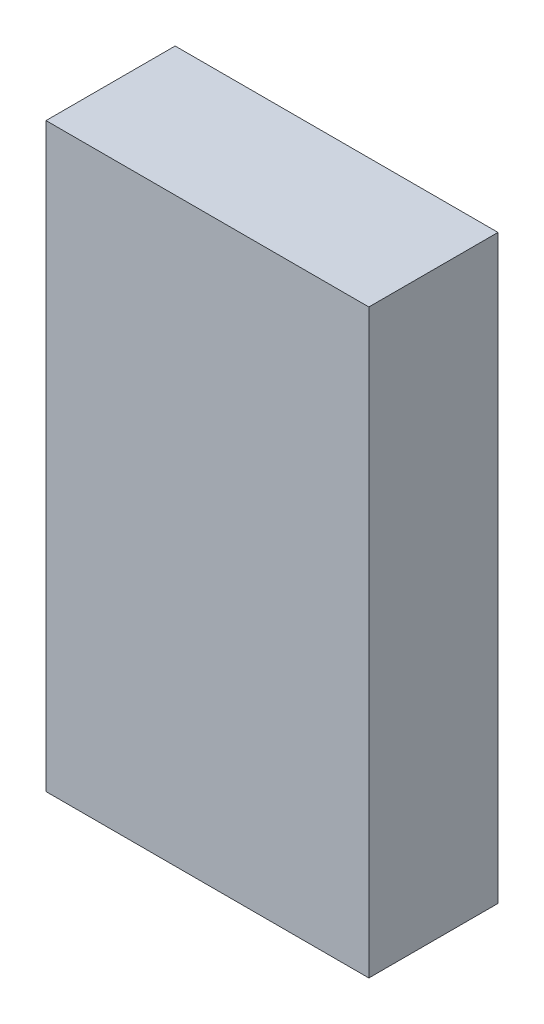
ISO-10303-21;
HEADER;
FILE_DESCRIPTION(('STEP AP214'),'2;1');
FILE_NAME('part.step','',(''),(''),'','','');
FILE_SCHEMA(('AUTOMOTIVE_DESIGN { 1 0 10303 214 1 1 1 1 }'));
ENDSEC;
DATA;
#1=APPLICATION_CONTEXT('core data for automotive mechanical design processes');
#2=APPLICATION_PROTOCOL_DEFINITION('international standard','automotive_design',2000,#1);
#3=PRODUCT_CONTEXT('',#1,'mechanical');
#4=PRODUCT('Part','Part','',(#3));
#5=PRODUCT_RELATED_PRODUCT_CATEGORY('part','',(#4));
#6=PRODUCT_DEFINITION_FORMATION('','',#4);
#7=PRODUCT_DEFINITION_CONTEXT('part definition',#1,'design');
#8=PRODUCT_DEFINITION('design','',#6,#7);
#9=PRODUCT_DEFINITION_SHAPE('','',#8);
#10=(LENGTH_UNIT() NAMED_UNIT(*) SI_UNIT(.MILLI.,.METRE.));
#11=(NAMED_UNIT(*) PLANE_ANGLE_UNIT() SI_UNIT($,.RADIAN.));
#12=(NAMED_UNIT(*) SI_UNIT($,.STERADIAN.) SOLID_ANGLE_UNIT());
#13=UNCERTAINTY_MEASURE_WITH_UNIT(LENGTH_MEASURE(1.E-05),#10,'distance_accuracy_value','');
#14=(GEOMETRIC_REPRESENTATION_CONTEXT(3) GLOBAL_UNCERTAINTY_ASSIGNED_CONTEXT((#13)) GLOBAL_UNIT_ASSIGNED_CONTEXT((#10,
#11,#12)) REPRESENTATION_CONTEXT('',''));
#15=CARTESIAN_POINT('',(0.,0.,0.));
#16=DIRECTION('',(0.,0.,1.));
#17=DIRECTION('',(1.,0.,0.));
#18=AXIS2_PLACEMENT_3D('',#15,#16,#17);
#19=CARTESIAN_POINT('',(0.375,1.6,0.));
#20=DIRECTION('',(1.,0.,0.));
#21=DIRECTION('',(0.,0.,1.));
#22=AXIS2_PLACEMENT_3D('',#19,#20,#21);
#23=PLANE('',#22);
#24=DIRECTION('',(0.,1.,0.));
#25=VECTOR('',#24,1.);
#26=CARTESIAN_POINT('',(0.375,1.6,0.1));
#27=LINE('',#26,#25);
#28=CARTESIAN_POINT('',(0.375,1.6,0.1));
#29=VERTEX_POINT('',#28);
#30=CARTESIAN_POINT('',(0.375,2.05,0.1));
#31=VERTEX_POINT('',#30);
#32=EDGE_CURVE('E11',#29,#31,#27,.T.);
#33=ORIENTED_EDGE('',*,*,#32,.T.);
#34=DIRECTION('',(0.,0.,1.));
#35=VECTOR('',#34,1.);
#36=CARTESIAN_POINT('',(0.375,2.05,0.));
#37=LINE('',#36,#35);
#38=CARTESIAN_POINT('',(0.375,2.05,0.));
#39=VERTEX_POINT('',#38);
#40=EDGE_CURVE('E24',#39,#31,#37,.T.);
#41=ORIENTED_EDGE('',*,*,#40,.F.);
#42=DIRECTION('',(0.,1.,0.));
#43=VECTOR('',#42,1.);
#44=CARTESIAN_POINT('',(0.375,1.6,0.));
#45=LINE('',#44,#43);
#46=CARTESIAN_POINT('',(0.375,1.6,0.));
#47=VERTEX_POINT('',#46);
#48=EDGE_CURVE('E86',#47,#39,#45,.T.);
#49=ORIENTED_EDGE('',*,*,#48,.F.);
#50=DIRECTION('',(0.,0.,1.));
#51=VECTOR('',#50,1.);
#52=CARTESIAN_POINT('',(0.375,1.6,0.));
#53=LINE('',#52,#51);
#54=EDGE_CURVE('E36',#47,#29,#53,.T.);
#55=ORIENTED_EDGE('',*,*,#54,.T.);
#56=EDGE_LOOP('',(#33,#41,#49,#55));
#57=FACE_BOUND('',#56,.T.);
#58=ADVANCED_FACE('F17',(#57),#23,.F.);
#59=CARTESIAN_POINT('',(0.625,1.6,0.));
#60=DIRECTION('',(1.,0.,0.));
#61=DIRECTION('',(0.,0.,1.));
#62=AXIS2_PLACEMENT_3D('',#59,#60,#61);
#63=PLANE('',#62);
#64=DIRECTION('',(0.,0.,1.));
#65=VECTOR('',#64,1.);
#66=CARTESIAN_POINT('',(0.625,1.6,0.));
#67=LINE('',#66,#65);
#68=CARTESIAN_POINT('',(0.625,1.6,0.));
#69=VERTEX_POINT('',#68);
#70=CARTESIAN_POINT('',(0.625,1.6,0.1));
#71=VERTEX_POINT('',#70);
#72=EDGE_CURVE('E83',#69,#71,#67,.T.);
#73=ORIENTED_EDGE('',*,*,#72,.F.);
#74=DIRECTION('',(0.,1.,0.));
#75=VECTOR('',#74,1.);
#76=CARTESIAN_POINT('',(0.625,1.6,0.));
#77=LINE('',#76,#75);
#78=CARTESIAN_POINT('',(0.625,2.05,0.));
#79=VERTEX_POINT('',#78);
#80=EDGE_CURVE('E63',#69,#79,#77,.T.);
#81=ORIENTED_EDGE('',*,*,#80,.T.);
#82=DIRECTION('',(0.,0.,1.));
#83=VECTOR('',#82,1.);
#84=CARTESIAN_POINT('',(0.625,2.05,0.));
#85=LINE('',#84,#83);
#86=CARTESIAN_POINT('',(0.625,2.05,0.1));
#87=VERTEX_POINT('',#86);
#88=EDGE_CURVE('E57',#79,#87,#85,.T.);
#89=ORIENTED_EDGE('',*,*,#88,.T.);
#90=DIRECTION('',(0.,1.,0.));
#91=VECTOR('',#90,1.);
#92=CARTESIAN_POINT('',(0.625,1.6,0.1));
#93=LINE('',#92,#91);
#94=EDGE_CURVE('E60',#71,#87,#93,.T.);
#95=ORIENTED_EDGE('',*,*,#94,.F.);
#96=EDGE_LOOP('',(#73,#81,#89,#95));
#97=FACE_BOUND('',#96,.T.);
#98=ADVANCED_FACE('F59',(#97),#63,.T.);
#99=CARTESIAN_POINT('',(0.375,1.6,0.));
#100=DIRECTION('',(0.,1.,0.));
#101=DIRECTION('',(0.,0.,1.));
#102=AXIS2_PLACEMENT_3D('',#99,#100,#101);
#103=PLANE('',#102);
#104=ORIENTED_EDGE('',*,*,#72,.T.);
#105=DIRECTION('',(1.,0.,0.));
#106=VECTOR('',#105,1.);
#107=CARTESIAN_POINT('',(0.375,1.6,0.1));
#108=LINE('',#107,#106);
#109=EDGE_CURVE('E71',#29,#71,#108,.T.);
#110=ORIENTED_EDGE('',*,*,#109,.F.);
#111=ORIENTED_EDGE('',*,*,#54,.F.);
#112=DIRECTION('',(1.,0.,0.));
#113=VECTOR('',#112,1.);
#114=CARTESIAN_POINT('',(0.375,1.6,0.));
#115=LINE('',#114,#113);
#116=EDGE_CURVE('E76',#47,#69,#115,.T.);
#117=ORIENTED_EDGE('',*,*,#116,.T.);
#118=EDGE_LOOP('',(#104,#110,#111,#117));
#119=FACE_BOUND('',#118,.T.);
#120=ADVANCED_FACE('F91',(#119),#103,.F.);
#121=CARTESIAN_POINT('',(0.375,2.05,0.));
#122=DIRECTION('',(0.,1.,0.));
#123=DIRECTION('',(0.,0.,1.));
#124=AXIS2_PLACEMENT_3D('',#121,#122,#123);
#125=PLANE('',#124);
#126=DIRECTION('',(1.,0.,0.));
#127=VECTOR('',#126,1.);
#128=CARTESIAN_POINT('',(0.375,2.05,0.));
#129=LINE('',#128,#127);
#130=EDGE_CURVE('E74',#39,#79,#129,.T.);
#131=ORIENTED_EDGE('',*,*,#130,.F.);
#132=ORIENTED_EDGE('',*,*,#40,.T.);
#133=DIRECTION('',(1.,0.,0.));
#134=VECTOR('',#133,1.);
#135=CARTESIAN_POINT('',(0.375,2.05,0.1));
#136=LINE('',#135,#134);
#137=EDGE_CURVE('E69',#31,#87,#136,.T.);
#138=ORIENTED_EDGE('',*,*,#137,.T.);
#139=ORIENTED_EDGE('',*,*,#88,.F.);
#140=EDGE_LOOP('',(#131,#132,#138,#139));
#141=FACE_BOUND('',#140,.T.);
#142=ADVANCED_FACE('F73',(#141),#125,.T.);
#143=CARTESIAN_POINT('',(0.375,1.6,0.));
#144=DIRECTION('',(0.,0.,1.));
#145=DIRECTION('',(1.,0.,0.));
#146=AXIS2_PLACEMENT_3D('',#143,#144,#145);
#147=PLANE('',#146);
#148=ORIENTED_EDGE('',*,*,#130,.T.);
#149=ORIENTED_EDGE('',*,*,#80,.F.);
#150=ORIENTED_EDGE('',*,*,#116,.F.);
#151=ORIENTED_EDGE('',*,*,#48,.T.);
#152=EDGE_LOOP('',(#148,#149,#150,#151));
#153=FACE_BOUND('',#152,.T.);
#154=ADVANCED_FACE('F89',(#153),#147,.F.);
#155=CARTESIAN_POINT('',(0.375,1.6,0.1));
#156=DIRECTION('',(0.,0.,1.));
#157=DIRECTION('',(1.,0.,0.));
#158=AXIS2_PLACEMENT_3D('',#155,#156,#157);
#159=PLANE('',#158);
#160=ORIENTED_EDGE('',*,*,#32,.F.);
#161=ORIENTED_EDGE('',*,*,#109,.T.);
#162=ORIENTED_EDGE('',*,*,#94,.T.);
#163=ORIENTED_EDGE('',*,*,#137,.F.);
#164=EDGE_LOOP('',(#160,#161,#162,#163));
#165=FACE_BOUND('',#164,.T.);
#166=ADVANCED_FACE('F68',(#165),#159,.T.);
#167=CLOSED_SHELL('',(#58,#98,#120,#142,#154,#166));
#168=MANIFOLD_SOLID_BREP('B1',#167);
#169=ADVANCED_BREP_SHAPE_REPRESENTATION('',(#18,#168),#14);
#170=SHAPE_DEFINITION_REPRESENTATION(#9,#169);
ENDSEC;
END-ISO-10303-21;
